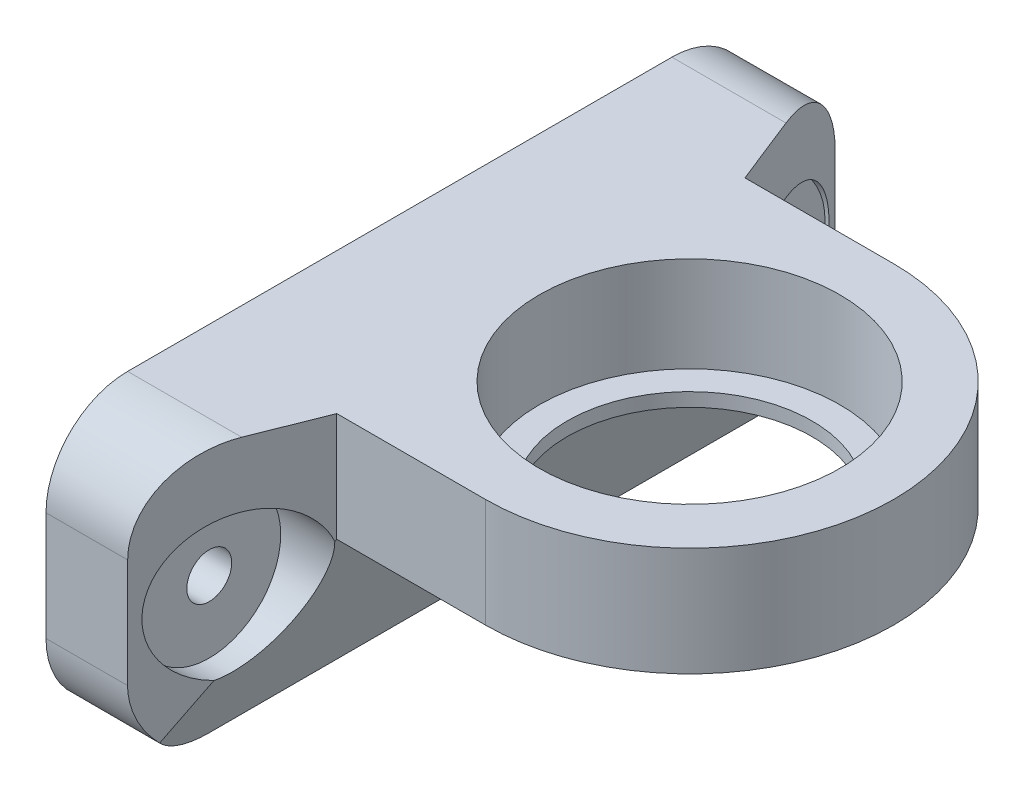
ISO-10303-21;
HEADER;
FILE_DESCRIPTION(('STEP AP214'),'2;1');
FILE_NAME('part.step','',(''),(''),'','','');
FILE_SCHEMA(('AUTOMOTIVE_DESIGN { 1 0 10303 214 1 1 1 1 }'));
ENDSEC;
DATA;
#1=APPLICATION_CONTEXT('core data for automotive mechanical design processes');
#2=APPLICATION_PROTOCOL_DEFINITION('international standard','automotive_design',2000,#1);
#3=PRODUCT_CONTEXT('',#1,'mechanical');
#4=PRODUCT('Part','Part','',(#3));
#5=PRODUCT_RELATED_PRODUCT_CATEGORY('part','',(#4));
#6=PRODUCT_DEFINITION_FORMATION('','',#4);
#7=PRODUCT_DEFINITION_CONTEXT('part definition',#1,'design');
#8=PRODUCT_DEFINITION('design','',#6,#7);
#9=PRODUCT_DEFINITION_SHAPE('','',#8);
#10=(LENGTH_UNIT() NAMED_UNIT(*) SI_UNIT(.MILLI.,.METRE.));
#11=(NAMED_UNIT(*) PLANE_ANGLE_UNIT() SI_UNIT($,.RADIAN.));
#12=(NAMED_UNIT(*) SI_UNIT($,.STERADIAN.) SOLID_ANGLE_UNIT());
#13=UNCERTAINTY_MEASURE_WITH_UNIT(LENGTH_MEASURE(1.E-05),#10,'distance_accuracy_value','');
#14=(GEOMETRIC_REPRESENTATION_CONTEXT(3) GLOBAL_UNCERTAINTY_ASSIGNED_CONTEXT((#13)) GLOBAL_UNIT_ASSIGNED_CONTEXT((#10,
#11,#12)) REPRESENTATION_CONTEXT('',''));
#15=CARTESIAN_POINT('',(0.,0.,0.));
#16=DIRECTION('',(0.,0.,1.));
#17=DIRECTION('',(1.,0.,0.));
#18=AXIS2_PLACEMENT_3D('',#15,#16,#17);
#19=CARTESIAN_POINT('',(36.3,10.,9.99999999999999));
#20=DIRECTION('',(-1.,0.,0.));
#21=DIRECTION('',(0.,-1.,0.));
#22=AXIS2_PLACEMENT_3D('',#19,#20,#21);
#23=CYLINDRICAL_SURFACE('',#22,1.65);
#24=CARTESIAN_POINT('',(1.,9.99999999999999,9.99999999999999));
#25=DIRECTION('',(1.,0.,0.));
#26=DIRECTION('',(0.,0.,-1.));
#27=AXIS2_PLACEMENT_3D('',#24,#25,#26);
#28=CIRCLE('',#27,1.65);
#29=CARTESIAN_POINT('',(1.,9.99999999999999,8.34999999999999));
#30=VERTEX_POINT('',#29);
#31=EDGE_CURVE('E204',#30,#30,#28,.F.);
#32=ORIENTED_EDGE('',*,*,#31,.T.);
#33=EDGE_LOOP('',(#32));
#34=FACE_BOUND('',#33,.T.);
#35=CARTESIAN_POINT('',(6.,9.99999999999999,9.99999999999999));
#36=DIRECTION('',(1.,0.,0.));
#37=DIRECTION('',(0.,0.,-1.));
#38=AXIS2_PLACEMENT_3D('',#35,#36,#37);
#39=CIRCLE('',#38,1.65);
#40=CARTESIAN_POINT('',(6.,9.99999999999999,8.34999999999999));
#41=VERTEX_POINT('',#40);
#42=EDGE_CURVE('E160',#41,#41,#39,.F.);
#43=ORIENTED_EDGE('',*,*,#42,.F.);
#44=EDGE_LOOP('',(#43));
#45=FACE_BOUND('',#44,.T.);
#46=ADVANCED_FACE('F34',(#34,#45),#23,.F.);
#47=CARTESIAN_POINT('',(36.3,10.,50.));
#48=DIRECTION('',(-1.,0.,0.));
#49=DIRECTION('',(0.,-1.,0.));
#50=AXIS2_PLACEMENT_3D('',#47,#48,#49);
#51=CYLINDRICAL_SURFACE('',#50,1.65);
#52=CARTESIAN_POINT('',(1.,10.,50.));
#53=DIRECTION('',(1.,0.,0.));
#54=DIRECTION('',(0.,0.,-1.));
#55=AXIS2_PLACEMENT_3D('',#52,#53,#54);
#56=CIRCLE('',#55,1.65);
#57=CARTESIAN_POINT('',(1.,10.,48.35));
#58=VERTEX_POINT('',#57);
#59=EDGE_CURVE('E200',#58,#58,#56,.F.);
#60=ORIENTED_EDGE('',*,*,#59,.T.);
#61=EDGE_LOOP('',(#60));
#62=FACE_BOUND('',#61,.T.);
#63=CARTESIAN_POINT('',(6.,10.,50.));
#64=DIRECTION('',(1.,0.,0.));
#65=DIRECTION('',(0.,0.,-1.));
#66=AXIS2_PLACEMENT_3D('',#63,#64,#65);
#67=CIRCLE('',#66,1.65);
#68=CARTESIAN_POINT('',(6.,10.,48.35));
#69=VERTEX_POINT('',#68);
#70=EDGE_CURVE('E192',#69,#69,#67,.F.);
#71=ORIENTED_EDGE('',*,*,#70,.F.);
#72=EDGE_LOOP('',(#71));
#73=FACE_BOUND('',#72,.T.);
#74=ADVANCED_FACE('F331',(#62,#73),#51,.F.);
#75=CARTESIAN_POINT('',(21.3,20.,30.));
#76=DIRECTION('',(0.,-1.,0.));
#77=DIRECTION('',(0.,0.,-1.));
#78=AXIS2_PLACEMENT_3D('',#75,#76,#77);
#79=CYLINDRICAL_SURFACE('',#78,9.00000000000001);
#80=CARTESIAN_POINT('',(21.3,12.,30.));
#81=DIRECTION('',(0.,1.,0.));
#82=DIRECTION('',(-1.,0.,0.));
#83=AXIS2_PLACEMENT_3D('',#80,#81,#82);
#84=CIRCLE('',#83,9.00000000000001);
#85=CARTESIAN_POINT('',(12.3,12.,30.));
#86=VERTEX_POINT('',#85);
#87=EDGE_CURVE('E169',#86,#86,#84,.T.);
#88=ORIENTED_EDGE('',*,*,#87,.F.);
#89=EDGE_LOOP('',(#88));
#90=FACE_BOUND('',#89,.T.);
#91=CARTESIAN_POINT('',(21.3,13.,30.));
#92=DIRECTION('',(0.,1.,0.));
#93=DIRECTION('',(-1.,0.,0.));
#94=AXIS2_PLACEMENT_3D('',#91,#92,#93);
#95=CIRCLE('',#94,9.00000000000001);
#96=CARTESIAN_POINT('',(12.3,13.,30.));
#97=VERTEX_POINT('',#96);
#98=EDGE_CURVE('E187',#97,#97,#95,.F.);
#99=ORIENTED_EDGE('',*,*,#98,.F.);
#100=EDGE_LOOP('',(#99));
#101=FACE_BOUND('',#100,.T.);
#102=ADVANCED_FACE('F368',(#90,#101),#79,.F.);
#103=CARTESIAN_POINT('',(0.,20.,60.));
#104=DIRECTION('',(1.,0.,0.));
#105=DIRECTION('',(0.,1.,0.));
#106=AXIS2_PLACEMENT_3D('',#103,#104,#105);
#107=PLANE('',#106);
#108=CARTESIAN_POINT('',(0.,9.99999999999999,9.99999999999999));
#109=DIRECTION('',(1.,0.,0.));
#110=DIRECTION('',(0.,0.,-1.));
#111=AXIS2_PLACEMENT_3D('',#108,#109,#110);
#112=CIRCLE('',#111,5.25);
#113=CARTESIAN_POINT('',(0.,9.99999999999999,4.74999999999999));
#114=VERTEX_POINT('',#113);
#115=EDGE_CURVE('E313',#114,#114,#112,.T.);
#116=ORIENTED_EDGE('',*,*,#115,.T.);
#117=EDGE_LOOP('',(#116));
#118=FACE_BOUND('',#117,.T.);
#119=CARTESIAN_POINT('',(0.,10.,50.));
#120=DIRECTION('',(1.,0.,0.));
#121=DIRECTION('',(0.,0.,-1.));
#122=AXIS2_PLACEMENT_3D('',#119,#120,#121);
#123=CIRCLE('',#122,5.25);
#124=CARTESIAN_POINT('',(0.,10.,44.75));
#125=VERTEX_POINT('',#124);
#126=EDGE_CURVE('E207',#125,#125,#123,.T.);
#127=ORIENTED_EDGE('',*,*,#126,.T.);
#128=EDGE_LOOP('',(#127));
#129=FACE_BOUND('',#128,.T.);
#130=DIRECTION('',(0.,-1.,0.));
#131=VECTOR('',#130,1.);
#132=CARTESIAN_POINT('',(0.,20.,4.));
#133=LINE('',#132,#131);
#134=CARTESIAN_POINT('',(0.,14.,4.));
#135=VERTEX_POINT('',#134);
#136=CARTESIAN_POINT('',(0.,6.,4.));
#137=VERTEX_POINT('',#136);
#138=EDGE_CURVE('E287',#135,#137,#133,.T.);
#139=ORIENTED_EDGE('',*,*,#138,.T.);
#140=CARTESIAN_POINT('',(0.,6.,10.));
#141=DIRECTION('',(1.,0.,0.));
#142=DIRECTION('',(0.,1.,0.));
#143=AXIS2_PLACEMENT_3D('',#140,#141,#142);
#144=CIRCLE('',#143,6.);
#145=CARTESIAN_POINT('',(0.,0.,10.));
#146=VERTEX_POINT('',#145);
#147=EDGE_CURVE('E219',#137,#146,#144,.F.);
#148=ORIENTED_EDGE('',*,*,#147,.T.);
#149=DIRECTION('',(0.,0.,-1.));
#150=VECTOR('',#149,1.);
#151=CARTESIAN_POINT('',(0.,0.,60.));
#152=LINE('',#151,#150);
#153=CARTESIAN_POINT('',(0.,0.,50.));
#154=VERTEX_POINT('',#153);
#155=EDGE_CURVE('E184',#154,#146,#152,.T.);
#156=ORIENTED_EDGE('',*,*,#155,.F.);
#157=CARTESIAN_POINT('',(0.,6.,50.));
#158=DIRECTION('',(1.,0.,0.));
#159=DIRECTION('',(0.,1.,0.));
#160=AXIS2_PLACEMENT_3D('',#157,#158,#159);
#161=CIRCLE('',#160,6.);
#162=CARTESIAN_POINT('',(0.,6.,56.));
#163=VERTEX_POINT('',#162);
#164=EDGE_CURVE('E213',#154,#163,#161,.F.);
#165=ORIENTED_EDGE('',*,*,#164,.T.);
#166=DIRECTION('',(0.,-1.,0.));
#167=VECTOR('',#166,1.);
#168=CARTESIAN_POINT('',(0.,20.,56.));
#169=LINE('',#168,#167);
#170=CARTESIAN_POINT('',(0.,14.,56.));
#171=VERTEX_POINT('',#170);
#172=EDGE_CURVE('E246',#171,#163,#169,.T.);
#173=ORIENTED_EDGE('',*,*,#172,.F.);
#174=CARTESIAN_POINT('',(0.,14.,50.));
#175=DIRECTION('',(1.,0.,0.));
#176=DIRECTION('',(0.,1.,0.));
#177=AXIS2_PLACEMENT_3D('',#174,#175,#176);
#178=CIRCLE('',#177,6.);
#179=CARTESIAN_POINT('',(0.,20.,50.));
#180=VERTEX_POINT('',#179);
#181=EDGE_CURVE('E215',#171,#180,#178,.F.);
#182=ORIENTED_EDGE('',*,*,#181,.T.);
#183=DIRECTION('',(0.,0.,-1.));
#184=VECTOR('',#183,1.);
#185=CARTESIAN_POINT('',(0.,20.,60.));
#186=LINE('',#185,#184);
#187=CARTESIAN_POINT('',(0.,20.,10.));
#188=VERTEX_POINT('',#187);
#189=EDGE_CURVE('E177',#180,#188,#186,.T.);
#190=ORIENTED_EDGE('',*,*,#189,.T.);
#191=CARTESIAN_POINT('',(0.,14.,9.99999999999999));
#192=DIRECTION('',(1.,0.,0.));
#193=DIRECTION('',(0.,1.,0.));
#194=AXIS2_PLACEMENT_3D('',#191,#192,#193);
#195=CIRCLE('',#194,6.);
#196=EDGE_CURVE('E217',#188,#135,#195,.F.);
#197=ORIENTED_EDGE('',*,*,#196,.T.);
#198=EDGE_LOOP('',(#139,#148,#156,#165,#173,#182,#190,#197));
#199=FACE_BOUND('',#198,.T.);
#200=ADVANCED_FACE('F391',(#118,#129,#199),#107,.F.);
#201=CARTESIAN_POINT('',(0.,0.,60.));
#202=DIRECTION('',(0.,1.,0.));
#203=DIRECTION('',(0.,0.,1.));
#204=AXIS2_PLACEMENT_3D('',#201,#202,#203);
#205=PLANE('',#204);
#206=ORIENTED_EDGE('',*,*,#155,.T.);
#207=DIRECTION('',(-1.,0.,0.));
#208=VECTOR('',#207,1.);
#209=CARTESIAN_POINT('',(0.,0.,9.99999999999999));
#210=LINE('',#209,#208);
#211=CARTESIAN_POINT('',(6.,0.,10.));
#212=VERTEX_POINT('',#211);
#213=EDGE_CURVE('E223',#146,#212,#210,.F.);
#214=ORIENTED_EDGE('',*,*,#213,.T.);
#215=DIRECTION('',(0.,0.,-1.));
#216=VECTOR('',#215,1.);
#217=CARTESIAN_POINT('',(6.,0.,60.));
#218=LINE('',#217,#216);
#219=CARTESIAN_POINT('',(6.,0.,50.));
#220=VERTEX_POINT('',#219);
#221=EDGE_CURVE('E182',#220,#212,#218,.T.);
#222=ORIENTED_EDGE('',*,*,#221,.F.);
#223=DIRECTION('',(1.,0.,0.));
#224=VECTOR('',#223,1.);
#225=CARTESIAN_POINT('',(0.,0.,50.));
#226=LINE('',#225,#224);
#227=EDGE_CURVE('E221',#220,#154,#226,.F.);
#228=ORIENTED_EDGE('',*,*,#227,.T.);
#229=EDGE_LOOP('',(#206,#214,#222,#228));
#230=FACE_BOUND('',#229,.T.);
#231=ADVANCED_FACE('F401',(#230),#205,.F.);
#232=CARTESIAN_POINT('',(6.,0.,60.));
#233=DIRECTION('',(-0.939692620785911,0.342020143325663,0.));
#234=DIRECTION('',(-0.342020143325663,-0.939692620785911,0.));
#235=AXIS2_PLACEMENT_3D('',#232,#233,#234);
#236=PLANE('',#235);
#237=ORIENTED_EDGE('',*,*,#221,.T.);
#238=CARTESIAN_POINT('',(8.18382140559717,6.,10.));
#239=DIRECTION('',(-0.939692620785911,0.342020143325663,0.));
#240=DIRECTION('',(-0.342020143325663,-0.939692620785911,0.));
#241=AXIS2_PLACEMENT_3D('',#238,#239,#240);
#242=ELLIPSE('',#241,6.38506663485546,6.);
#243=CARTESIAN_POINT('',(6.66769785929932,1.83448479144311,5.68161105882283));
#244=VERTEX_POINT('',#243);
#245=EDGE_CURVE('E227',#212,#244,#242,.F.);
#246=ORIENTED_EDGE('',*,*,#245,.T.);
#247=DIRECTION('',(0.259137109387964,0.711973356586187,0.652642243537337));
#248=VECTOR('',#247,1.);
#249=CARTESIAN_POINT('',(15.4709341694655,26.0211777717482,27.8527462907692));
#250=LINE('',#249,#248);
#251=CARTESIAN_POINT('',(7.80390166501923,4.95617909155704,8.5431641672606));
#252=VERTEX_POINT('',#251);
#253=EDGE_CURVE('E158',#244,#252,#250,.T.);
#254=ORIENTED_EDGE('',*,*,#253,.T.);
#255=CARTESIAN_POINT('',(9.63970234266195,9.99999999999999,9.99999999999999));
#256=DIRECTION('',(-0.939692620785911,0.342020143325663,0.));
#257=DIRECTION('',(-0.342020143325663,-0.939692620785911,0.));
#258=AXIS2_PLACEMENT_3D('',#255,#256,#257);
#259=ELLIPSE('',#258,5.58693330549853,5.25);
#260=CARTESIAN_POINT('',(10.3272799416385,11.8891039273109,14.8983452667017));
#261=VERTEX_POINT('',#260);
#262=EDGE_CURVE('E145',#261,#252,#259,.F.);
#263=ORIENTED_EDGE('',*,*,#262,.F.);
#264=CARTESIAN_POINT('',(10.3676428111943,12.,15.));
#265=VERTEX_POINT('',#264);
#266=EDGE_CURVE('E156',#261,#265,#250,.T.);
#267=ORIENTED_EDGE('',*,*,#266,.T.);
#268=DIRECTION('',(0.,0.,-1.));
#269=VECTOR('',#268,1.);
#270=CARTESIAN_POINT('',(10.3676428111943,12.,60.));
#271=LINE('',#270,#269);
#272=CARTESIAN_POINT('',(10.3676428111943,12.,45.));
#273=VERTEX_POINT('',#272);
#274=EDGE_CURVE('E180',#273,#265,#271,.T.);
#275=ORIENTED_EDGE('',*,*,#274,.F.);
#276=DIRECTION('',(-0.259137109387964,-0.711973356586187,0.652642243537337));
#277=VECTOR('',#276,1.);
#278=CARTESIAN_POINT('',(5.32350470218103,-1.85865555512487,57.7037675921978));
#279=LINE('',#278,#277);
#280=CARTESIAN_POINT('',(10.3272799416385,11.8891039273109,45.1016547332983));
#281=VERTEX_POINT('',#280);
#282=EDGE_CURVE('E260',#273,#281,#279,.T.);
#283=ORIENTED_EDGE('',*,*,#282,.T.);
#284=CARTESIAN_POINT('',(9.63970234266195,10.,50.));
#285=DIRECTION('',(-0.939692620785911,0.342020143325663,0.));
#286=DIRECTION('',(-0.342020143325663,-0.939692620785911,0.));
#287=AXIS2_PLACEMENT_3D('',#284,#285,#286);
#288=ELLIPSE('',#287,5.58693330549852,5.25);
#289=CARTESIAN_POINT('',(7.80390166501923,4.95617909155703,51.4568358327394));
#290=VERTEX_POINT('',#289);
#291=EDGE_CURVE('E195',#290,#281,#288,.F.);
#292=ORIENTED_EDGE('',*,*,#291,.F.);
#293=CARTESIAN_POINT('',(6.66769785929932,1.8344847914431,54.3183889411772));
#294=VERTEX_POINT('',#293);
#295=EDGE_CURVE('E264',#290,#294,#279,.T.);
#296=ORIENTED_EDGE('',*,*,#295,.T.);
#297=CARTESIAN_POINT('',(8.18382140559717,6.,50.));
#298=DIRECTION('',(-0.939692620785911,0.342020143325663,0.));
#299=DIRECTION('',(0.342020143325663,0.939692620785911,0.));
#300=AXIS2_PLACEMENT_3D('',#297,#298,#299);
#301=ELLIPSE('',#300,6.38506663485546,6.);
#302=EDGE_CURVE('E225',#294,#220,#301,.F.);
#303=ORIENTED_EDGE('',*,*,#302,.T.);
#304=EDGE_LOOP('',(#237,#246,#254,#263,#267,#275,#283,#292,#296,#303));
#305=FACE_BOUND('',#304,.T.);
#306=ADVANCED_FACE('F154',(#305),#236,.F.);
#307=CARTESIAN_POINT('',(10.3676428111943,12.,60.));
#308=DIRECTION('',(0.,1.,0.));
#309=DIRECTION('',(-1.,0.,0.));
#310=AXIS2_PLACEMENT_3D('',#307,#308,#309);
#311=PLANE('',#310);
#312=ORIENTED_EDGE('',*,*,#87,.T.);
#313=EDGE_LOOP('',(#312));
#314=FACE_BOUND('',#313,.T.);
#315=ORIENTED_EDGE('',*,*,#274,.T.);
#316=DIRECTION('',(1.,0.,0.));
#317=VECTOR('',#316,1.);
#318=CARTESIAN_POINT('',(10.3676428111944,12.,15.));
#319=LINE('',#318,#317);
#320=CARTESIAN_POINT('',(21.3,12.,15.));
#321=VERTEX_POINT('',#320);
#322=EDGE_CURVE('E167',#265,#321,#319,.T.);
#323=ORIENTED_EDGE('',*,*,#322,.T.);
#324=CARTESIAN_POINT('',(21.3,12.,30.));
#325=DIRECTION('',(0.,1.,0.));
#326=DIRECTION('',(-1.,0.,0.));
#327=AXIS2_PLACEMENT_3D('',#324,#325,#326);
#328=CIRCLE('',#327,15.);
#329=CARTESIAN_POINT('',(21.3,12.,45.));
#330=VERTEX_POINT('',#329);
#331=EDGE_CURVE('E171',#321,#330,#328,.F.);
#332=ORIENTED_EDGE('',*,*,#331,.T.);
#333=DIRECTION('',(-1.,0.,0.));
#334=VECTOR('',#333,1.);
#335=CARTESIAN_POINT('',(10.3676428111943,12.,45.));
#336=LINE('',#335,#334);
#337=EDGE_CURVE('E263',#330,#273,#336,.T.);
#338=ORIENTED_EDGE('',*,*,#337,.T.);
#339=EDGE_LOOP('',(#315,#323,#332,#338));
#340=FACE_BOUND('',#339,.T.);
#341=ADVANCED_FACE('F268',(#314,#340),#311,.F.);
#342=CARTESIAN_POINT('',(49.,20.,60.));
#343=DIRECTION('',(0.,-1.,0.));
#344=DIRECTION('',(1.,0.,0.));
#345=AXIS2_PLACEMENT_3D('',#342,#343,#344);
#346=PLANE('',#345);
#347=CARTESIAN_POINT('',(21.3,20.,30.));
#348=DIRECTION('',(0.,1.,0.));
#349=DIRECTION('',(-1.,0.,0.));
#350=AXIS2_PLACEMENT_3D('',#347,#348,#349);
#351=CIRCLE('',#350,11.05);
#352=CARTESIAN_POINT('',(10.25,20.,30.));
#353=VERTEX_POINT('',#352);
#354=EDGE_CURVE('E299',#353,#353,#351,.T.);
#355=ORIENTED_EDGE('',*,*,#354,.F.);
#356=EDGE_LOOP('',(#355));
#357=FACE_BOUND('',#356,.T.);
#358=DIRECTION('',(-0.369032637895796,0.,-0.929416436355453));
#359=VECTOR('',#358,1.);
#360=CARTESIAN_POINT('',(10.3676428111943,20.,15.));
#361=LINE('',#360,#359);
#362=CARTESIAN_POINT('',(10.3676428111943,20.,15.));
#363=VERTEX_POINT('',#362);
#364=CARTESIAN_POINT('',(8.38235062428783,20.,9.99999999999999));
#365=VERTEX_POINT('',#364);
#366=EDGE_CURVE('E256',#363,#365,#361,.T.);
#367=ORIENTED_EDGE('',*,*,#366,.T.);
#368=DIRECTION('',(-1.,0.,0.));
#369=VECTOR('',#368,1.);
#370=CARTESIAN_POINT('',(49.,20.,9.99999999999999));
#371=LINE('',#370,#369);
#372=EDGE_CURVE('E236',#365,#188,#371,.T.);
#373=ORIENTED_EDGE('',*,*,#372,.T.);
#374=ORIENTED_EDGE('',*,*,#189,.F.);
#375=DIRECTION('',(1.,0.,0.));
#376=VECTOR('',#375,1.);
#377=CARTESIAN_POINT('',(49.,20.,50.));
#378=LINE('',#377,#376);
#379=CARTESIAN_POINT('',(8.38235062428782,20.,50.));
#380=VERTEX_POINT('',#379);
#381=EDGE_CURVE('E233',#180,#380,#378,.T.);
#382=ORIENTED_EDGE('',*,*,#381,.T.);
#383=DIRECTION('',(0.369032637895797,0.,-0.929416436355453));
#384=VECTOR('',#383,1.);
#385=CARTESIAN_POINT('',(10.3676428111943,20.,45.));
#386=LINE('',#385,#384);
#387=CARTESIAN_POINT('',(10.3676428111943,20.,45.));
#388=VERTEX_POINT('',#387);
#389=EDGE_CURVE('E190',#380,#388,#386,.T.);
#390=ORIENTED_EDGE('',*,*,#389,.T.);
#391=DIRECTION('',(1.,0.,0.));
#392=VECTOR('',#391,1.);
#393=CARTESIAN_POINT('',(10.3676428111943,20.,45.));
#394=LINE('',#393,#392);
#395=CARTESIAN_POINT('',(21.3,20.,45.));
#396=VERTEX_POINT('',#395);
#397=EDGE_CURVE('E295',#388,#396,#394,.T.);
#398=ORIENTED_EDGE('',*,*,#397,.T.);
#399=CARTESIAN_POINT('',(21.3,20.,30.));
#400=DIRECTION('',(0.,1.,0.));
#401=DIRECTION('',(0.,0.,-1.));
#402=AXIS2_PLACEMENT_3D('',#399,#400,#401);
#403=CIRCLE('',#402,15.);
#404=CARTESIAN_POINT('',(21.3,20.,15.));
#405=VERTEX_POINT('',#404);
#406=EDGE_CURVE('E293',#396,#405,#403,.T.);
#407=ORIENTED_EDGE('',*,*,#406,.T.);
#408=DIRECTION('',(-1.,0.,0.));
#409=VECTOR('',#408,1.);
#410=CARTESIAN_POINT('',(21.3,20.,15.));
#411=LINE('',#410,#409);
#412=EDGE_CURVE('E279',#405,#363,#411,.T.);
#413=ORIENTED_EDGE('',*,*,#412,.T.);
#414=EDGE_LOOP('',(#367,#373,#374,#382,#390,#398,#407,#413));
#415=FACE_BOUND('',#414,.T.);
#416=ADVANCED_FACE('F376',(#357,#415),#346,.F.);
#417=CARTESIAN_POINT('',(10.3676428111943,20.,15.));
#418=DIRECTION('',(-0.929416436355453,0.,0.369032637895796));
#419=DIRECTION('',(0.369032637895796,0.,0.929416436355453));
#420=AXIS2_PLACEMENT_3D('',#417,#418,#419);
#421=PLANE('',#420);
#422=ORIENTED_EDGE('',*,*,#253,.F.);
#423=CARTESIAN_POINT('',(8.38235062428783,6.,10.));
#424=DIRECTION('',(-0.929416436355453,0.,0.369032637895796));
#425=DIRECTION('',(-0.369032637895796,0.,-0.929416436355453));
#426=AXIS2_PLACEMENT_3D('',#423,#424,#425);
#427=ELLIPSE('',#426,6.45566375340635,6.);
#428=CARTESIAN_POINT('',(6.00000000000001,6.,4.));
#429=VERTEX_POINT('',#428);
#430=EDGE_CURVE('E231',#244,#429,#427,.F.);
#431=ORIENTED_EDGE('',*,*,#430,.T.);
#432=DIRECTION('',(0.,-1.,0.));
#433=VECTOR('',#432,1.);
#434=CARTESIAN_POINT('',(6.00000000000001,20.,4.));
#435=LINE('',#434,#433);
#436=CARTESIAN_POINT('',(6.00000000000001,14.,4.));
#437=VERTEX_POINT('',#436);
#438=EDGE_CURVE('E282',#437,#429,#435,.T.);
#439=ORIENTED_EDGE('',*,*,#438,.F.);
#440=CARTESIAN_POINT('',(8.38235062428783,14.,9.99999999999999));
#441=DIRECTION('',(-0.929416436355453,0.,0.369032637895796));
#442=DIRECTION('',(-0.369032637895796,0.,-0.929416436355453));
#443=AXIS2_PLACEMENT_3D('',#440,#441,#442);
#444=ELLIPSE('',#443,6.45566375340635,6.);
#445=EDGE_CURVE('E229',#437,#365,#444,.F.);
#446=ORIENTED_EDGE('',*,*,#445,.T.);
#447=ORIENTED_EDGE('',*,*,#366,.F.);
#448=DIRECTION('',(0.,-1.,0.));
#449=VECTOR('',#448,1.);
#450=CARTESIAN_POINT('',(10.3676428111943,20.,15.));
#451=LINE('',#450,#449);
#452=EDGE_CURVE('E165',#363,#265,#451,.T.);
#453=ORIENTED_EDGE('',*,*,#452,.T.);
#454=ORIENTED_EDGE('',*,*,#266,.F.);
#455=CARTESIAN_POINT('',(8.38235062428783,9.99999999999999,9.99999999999999));
#456=DIRECTION('',(-0.929416436355453,0.,0.369032637895796));
#457=DIRECTION('',(-0.369032637895796,0.,-0.929416436355453));
#458=AXIS2_PLACEMENT_3D('',#455,#456,#457);
#459=ELLIPSE('',#458,5.64870578423056,5.25);
#460=EDGE_CURVE('E142',#252,#261,#459,.F.);
#461=ORIENTED_EDGE('',*,*,#460,.F.);
#462=EDGE_LOOP('',(#422,#431,#439,#446,#447,#453,#454,#461));
#463=FACE_BOUND('',#462,.T.);
#464=ADVANCED_FACE('F163',(#463),#421,.F.);
#465=CARTESIAN_POINT('',(21.3,20.,15.));
#466=DIRECTION('',(0.,0.,1.));
#467=DIRECTION('',(1.,0.,0.));
#468=AXIS2_PLACEMENT_3D('',#465,#466,#467);
#469=PLANE('',#468);
#470=ORIENTED_EDGE('',*,*,#452,.F.);
#471=ORIENTED_EDGE('',*,*,#412,.F.);
#472=DIRECTION('',(0.,-1.,0.));
#473=VECTOR('',#472,1.);
#474=CARTESIAN_POINT('',(21.3,20.,15.));
#475=LINE('',#474,#473);
#476=EDGE_CURVE('E274',#405,#321,#475,.T.);
#477=ORIENTED_EDGE('',*,*,#476,.T.);
#478=ORIENTED_EDGE('',*,*,#322,.F.);
#479=EDGE_LOOP('',(#470,#471,#477,#478));
#480=FACE_BOUND('',#479,.T.);
#481=ADVANCED_FACE('F277',(#480),#469,.F.);
#482=CARTESIAN_POINT('',(21.3,20.,30.));
#483=DIRECTION('',(0.,-1.,0.));
#484=DIRECTION('',(0.,0.,-1.));
#485=AXIS2_PLACEMENT_3D('',#482,#483,#484);
#486=CYLINDRICAL_SURFACE('',#485,15.);
#487=ORIENTED_EDGE('',*,*,#476,.F.);
#488=ORIENTED_EDGE('',*,*,#406,.F.);
#489=DIRECTION('',(0.,-1.,0.));
#490=VECTOR('',#489,1.);
#491=CARTESIAN_POINT('',(21.3,20.,45.));
#492=LINE('',#491,#490);
#493=EDGE_CURVE('E254',#396,#330,#492,.T.);
#494=ORIENTED_EDGE('',*,*,#493,.T.);
#495=ORIENTED_EDGE('',*,*,#331,.F.);
#496=EDGE_LOOP('',(#487,#488,#494,#495));
#497=FACE_BOUND('',#496,.T.);
#498=ADVANCED_FACE('F272',(#497),#486,.T.);
#499=CARTESIAN_POINT('',(10.3676428111943,20.,45.));
#500=DIRECTION('',(0.,0.,-1.));
#501=DIRECTION('',(-1.,0.,0.));
#502=AXIS2_PLACEMENT_3D('',#499,#500,#501);
#503=PLANE('',#502);
#504=ORIENTED_EDGE('',*,*,#493,.F.);
#505=ORIENTED_EDGE('',*,*,#397,.F.);
#506=DIRECTION('',(0.,-1.,0.));
#507=VECTOR('',#506,1.);
#508=CARTESIAN_POINT('',(10.3676428111943,20.,45.));
#509=LINE('',#508,#507);
#510=EDGE_CURVE('E251',#388,#273,#509,.T.);
#511=ORIENTED_EDGE('',*,*,#510,.T.);
#512=ORIENTED_EDGE('',*,*,#337,.F.);
#513=EDGE_LOOP('',(#504,#505,#511,#512));
#514=FACE_BOUND('',#513,.T.);
#515=ADVANCED_FACE('F381',(#514),#503,.F.);
#516=CARTESIAN_POINT('',(10.3676428111943,20.,45.));
#517=DIRECTION('',(-0.929416436355453,0.,-0.369032637895797));
#518=DIRECTION('',(-0.369032637895797,0.,0.929416436355453));
#519=AXIS2_PLACEMENT_3D('',#516,#517,#518);
#520=PLANE('',#519);
#521=ORIENTED_EDGE('',*,*,#389,.F.);
#522=CARTESIAN_POINT('',(8.38235062428782,14.,50.));
#523=DIRECTION('',(-0.929416436355453,0.,-0.369032637895797));
#524=DIRECTION('',(0.369032637895797,0.,-0.929416436355453));
#525=AXIS2_PLACEMENT_3D('',#522,#523,#524);
#526=ELLIPSE('',#525,6.45566375340635,6.);
#527=CARTESIAN_POINT('',(6.,14.,56.));
#528=VERTEX_POINT('',#527);
#529=EDGE_CURVE('E57',#380,#528,#526,.F.);
#530=ORIENTED_EDGE('',*,*,#529,.T.);
#531=DIRECTION('',(0.,-1.,0.));
#532=VECTOR('',#531,1.);
#533=CARTESIAN_POINT('',(6.,20.,56.));
#534=LINE('',#533,#532);
#535=CARTESIAN_POINT('',(6.,6.,56.));
#536=VERTEX_POINT('',#535);
#537=EDGE_CURVE('E243',#528,#536,#534,.T.);
#538=ORIENTED_EDGE('',*,*,#537,.T.);
#539=CARTESIAN_POINT('',(8.38235062428783,6.,50.));
#540=DIRECTION('',(-0.929416436355453,0.,-0.369032637895797));
#541=DIRECTION('',(0.369032637895797,0.,-0.929416436355453));
#542=AXIS2_PLACEMENT_3D('',#539,#540,#541);
#543=ELLIPSE('',#542,6.45566375340635,6.);
#544=EDGE_CURVE('E49',#536,#294,#543,.F.);
#545=ORIENTED_EDGE('',*,*,#544,.T.);
#546=ORIENTED_EDGE('',*,*,#295,.F.);
#547=CARTESIAN_POINT('',(8.38235062428783,10.,50.));
#548=DIRECTION('',(-0.929416436355453,0.,-0.369032637895797));
#549=DIRECTION('',(-0.369032637895797,0.,0.929416436355453));
#550=AXIS2_PLACEMENT_3D('',#547,#548,#549);
#551=ELLIPSE('',#550,5.64870578423055,5.25);
#552=EDGE_CURVE('E150',#281,#290,#551,.F.);
#553=ORIENTED_EDGE('',*,*,#552,.F.);
#554=ORIENTED_EDGE('',*,*,#282,.F.);
#555=ORIENTED_EDGE('',*,*,#510,.F.);
#556=EDGE_LOOP('',(#521,#530,#538,#545,#546,#553,#554,#555));
#557=FACE_BOUND('',#556,.T.);
#558=ADVANCED_FACE('F248',(#557),#520,.F.);
#559=CARTESIAN_POINT('',(6.00000000000001,20.,4.));
#560=DIRECTION('',(0.,0.,1.));
#561=DIRECTION('',(1.,0.,0.));
#562=AXIS2_PLACEMENT_3D('',#559,#560,#561);
#563=PLANE('',#562);
#564=ORIENTED_EDGE('',*,*,#438,.T.);
#565=DIRECTION('',(-1.,0.,0.));
#566=VECTOR('',#565,1.);
#567=CARTESIAN_POINT('',(6.00000000000001,6.,4.));
#568=LINE('',#567,#566);
#569=EDGE_CURVE('E210',#429,#137,#568,.T.);
#570=ORIENTED_EDGE('',*,*,#569,.T.);
#571=ORIENTED_EDGE('',*,*,#138,.F.);
#572=DIRECTION('',(-1.,0.,0.));
#573=VECTOR('',#572,1.);
#574=CARTESIAN_POINT('',(6.00000000000001,14.,4.));
#575=LINE('',#574,#573);
#576=EDGE_CURVE('E149',#135,#437,#575,.F.);
#577=ORIENTED_EDGE('',*,*,#576,.T.);
#578=EDGE_LOOP('',(#564,#570,#571,#577));
#579=FACE_BOUND('',#578,.T.);
#580=ADVANCED_FACE('F370',(#579),#563,.F.);
#581=CARTESIAN_POINT('',(6.,20.,56.));
#582=DIRECTION('',(0.,0.,-1.));
#583=DIRECTION('',(-1.,0.,0.));
#584=AXIS2_PLACEMENT_3D('',#581,#582,#583);
#585=PLANE('',#584);
#586=ORIENTED_EDGE('',*,*,#537,.F.);
#587=DIRECTION('',(1.,0.,0.));
#588=VECTOR('',#587,1.);
#589=CARTESIAN_POINT('',(6.,14.,56.));
#590=LINE('',#589,#588);
#591=EDGE_CURVE('E11',#528,#171,#590,.F.);
#592=ORIENTED_EDGE('',*,*,#591,.T.);
#593=ORIENTED_EDGE('',*,*,#172,.T.);
#594=DIRECTION('',(1.,0.,0.));
#595=VECTOR('',#594,1.);
#596=CARTESIAN_POINT('',(6.,6.,56.));
#597=LINE('',#596,#595);
#598=EDGE_CURVE('E42',#163,#536,#597,.T.);
#599=ORIENTED_EDGE('',*,*,#598,.T.);
#600=EDGE_LOOP('',(#586,#592,#593,#599));
#601=FACE_BOUND('',#600,.T.);
#602=ADVANCED_FACE('F242',(#601),#585,.F.);
#603=CARTESIAN_POINT('',(21.3,13.,30.));
#604=DIRECTION('',(0.,1.,0.));
#605=DIRECTION('',(-1.,0.,0.));
#606=AXIS2_PLACEMENT_3D('',#603,#604,#605);
#607=PLANE('',#606);
#608=CARTESIAN_POINT('',(21.3,13.,30.));
#609=DIRECTION('',(0.,1.,0.));
#610=DIRECTION('',(-1.,0.,0.));
#611=AXIS2_PLACEMENT_3D('',#608,#609,#610);
#612=CIRCLE('',#611,11.05);
#613=CARTESIAN_POINT('',(10.25,13.,30.));
#614=VERTEX_POINT('',#613);
#615=EDGE_CURVE('E191',#614,#614,#612,.T.);
#616=ORIENTED_EDGE('',*,*,#615,.T.);
#617=EDGE_LOOP('',(#616));
#618=FACE_BOUND('',#617,.T.);
#619=ORIENTED_EDGE('',*,*,#98,.T.);
#620=EDGE_LOOP('',(#619));
#621=FACE_BOUND('',#620,.T.);
#622=ADVANCED_FACE('F359',(#618,#621),#607,.T.);
#623=CARTESIAN_POINT('',(21.3,13.,30.));
#624=DIRECTION('',(0.,1.,0.));
#625=DIRECTION('',(-1.,0.,0.));
#626=AXIS2_PLACEMENT_3D('',#623,#624,#625);
#627=CYLINDRICAL_SURFACE('',#626,11.05);
#628=ORIENTED_EDGE('',*,*,#615,.F.);
#629=EDGE_LOOP('',(#628));
#630=FACE_BOUND('',#629,.T.);
#631=ORIENTED_EDGE('',*,*,#354,.T.);
#632=EDGE_LOOP('',(#631));
#633=FACE_BOUND('',#632,.T.);
#634=ADVANCED_FACE('F357',(#630,#633),#627,.F.);
#635=CARTESIAN_POINT('',(16.,10.,50.));
#636=DIRECTION('',(-1.,0.,0.));
#637=DIRECTION('',(0.,0.,1.));
#638=AXIS2_PLACEMENT_3D('',#635,#636,#637);
#639=CYLINDRICAL_SURFACE('',#638,5.25);
#640=CARTESIAN_POINT('',(6.,10.,50.));
#641=DIRECTION('',(1.,0.,0.));
#642=DIRECTION('',(0.,0.,-1.));
#643=AXIS2_PLACEMENT_3D('',#640,#641,#642);
#644=CIRCLE('',#643,5.25);
#645=CARTESIAN_POINT('',(6.,10.,44.75));
#646=VERTEX_POINT('',#645);
#647=EDGE_CURVE('E159',#646,#646,#644,.T.);
#648=ORIENTED_EDGE('',*,*,#647,.F.);
#649=EDGE_LOOP('',(#648));
#650=FACE_BOUND('',#649,.T.);
#651=ORIENTED_EDGE('',*,*,#291,.T.);
#652=ORIENTED_EDGE('',*,*,#552,.T.);
#653=EDGE_LOOP('',(#651,#652));
#654=FACE_BOUND('',#653,.T.);
#655=ADVANCED_FACE('F353',(#650,#654),#639,.F.);
#656=CARTESIAN_POINT('',(6.,10.,50.));
#657=DIRECTION('',(1.,0.,0.));
#658=DIRECTION('',(0.,0.,-1.));
#659=AXIS2_PLACEMENT_3D('',#656,#657,#658);
#660=PLANE('',#659);
#661=ORIENTED_EDGE('',*,*,#647,.T.);
#662=EDGE_LOOP('',(#661));
#663=FACE_BOUND('',#662,.T.);
#664=ORIENTED_EDGE('',*,*,#70,.T.);
#665=EDGE_LOOP('',(#664));
#666=FACE_BOUND('',#665,.T.);
#667=ADVANCED_FACE('F346',(#663,#666),#660,.T.);
#668=CARTESIAN_POINT('',(16.,9.99999999999999,9.99999999999999));
#669=DIRECTION('',(-1.,0.,0.));
#670=DIRECTION('',(0.,0.,1.));
#671=AXIS2_PLACEMENT_3D('',#668,#669,#670);
#672=CYLINDRICAL_SURFACE('',#671,5.25);
#673=CARTESIAN_POINT('',(6.,9.99999999999999,9.99999999999999));
#674=DIRECTION('',(1.,0.,0.));
#675=DIRECTION('',(0.,0.,-1.));
#676=AXIS2_PLACEMENT_3D('',#673,#674,#675);
#677=CIRCLE('',#676,5.25);
#678=CARTESIAN_POINT('',(6.,9.99999999999999,4.74999999999999));
#679=VERTEX_POINT('',#678);
#680=EDGE_CURVE('E198',#679,#679,#677,.T.);
#681=ORIENTED_EDGE('',*,*,#680,.F.);
#682=EDGE_LOOP('',(#681));
#683=FACE_BOUND('',#682,.T.);
#684=ORIENTED_EDGE('',*,*,#262,.T.);
#685=ORIENTED_EDGE('',*,*,#460,.T.);
#686=EDGE_LOOP('',(#684,#685));
#687=FACE_BOUND('',#686,.T.);
#688=ADVANCED_FACE('F144',(#683,#687),#672,.F.);
#689=CARTESIAN_POINT('',(6.,9.99999999999999,9.99999999999999));
#690=DIRECTION('',(1.,0.,0.));
#691=DIRECTION('',(0.,0.,-1.));
#692=AXIS2_PLACEMENT_3D('',#689,#690,#691);
#693=PLANE('',#692);
#694=ORIENTED_EDGE('',*,*,#680,.T.);
#695=EDGE_LOOP('',(#694));
#696=FACE_BOUND('',#695,.T.);
#697=ORIENTED_EDGE('',*,*,#42,.T.);
#698=EDGE_LOOP('',(#697));
#699=FACE_BOUND('',#698,.T.);
#700=ADVANCED_FACE('F335',(#696,#699),#693,.T.);
#701=CARTESIAN_POINT('',(1.,10.,50.));
#702=DIRECTION('',(1.,0.,0.));
#703=DIRECTION('',(0.,0.,-1.));
#704=AXIS2_PLACEMENT_3D('',#701,#702,#703);
#705=PLANE('',#704);
#706=CARTESIAN_POINT('',(1.,10.,50.));
#707=DIRECTION('',(1.,0.,0.));
#708=DIRECTION('',(0.,0.,-1.));
#709=AXIS2_PLACEMENT_3D('',#706,#707,#708);
#710=CIRCLE('',#709,5.25);
#711=CARTESIAN_POINT('',(1.,10.,44.75));
#712=VERTEX_POINT('',#711);
#713=EDGE_CURVE('E203',#712,#712,#710,.T.);
#714=ORIENTED_EDGE('',*,*,#713,.F.);
#715=EDGE_LOOP('',(#714));
#716=FACE_BOUND('',#715,.T.);
#717=ORIENTED_EDGE('',*,*,#59,.F.);
#718=EDGE_LOOP('',(#717));
#719=FACE_BOUND('',#718,.T.);
#720=ADVANCED_FACE('F337',(#716,#719),#705,.F.);
#721=CARTESIAN_POINT('',(1.,10.,50.));
#722=DIRECTION('',(-1.,0.,0.));
#723=DIRECTION('',(0.,0.,1.));
#724=AXIS2_PLACEMENT_3D('',#721,#722,#723);
#725=CYLINDRICAL_SURFACE('',#724,5.25);
#726=ORIENTED_EDGE('',*,*,#713,.T.);
#727=EDGE_LOOP('',(#726));
#728=FACE_BOUND('',#727,.T.);
#729=ORIENTED_EDGE('',*,*,#126,.F.);
#730=EDGE_LOOP('',(#729));
#731=FACE_BOUND('',#730,.T.);
#732=ADVANCED_FACE('F325',(#728,#731),#725,.F.);
#733=CARTESIAN_POINT('',(1.,9.99999999999999,9.99999999999999));
#734=DIRECTION('',(1.,0.,0.));
#735=DIRECTION('',(0.,0.,-1.));
#736=AXIS2_PLACEMENT_3D('',#733,#734,#735);
#737=PLANE('',#736);
#738=CARTESIAN_POINT('',(1.,9.99999999999999,9.99999999999999));
#739=DIRECTION('',(1.,0.,0.));
#740=DIRECTION('',(0.,0.,-1.));
#741=AXIS2_PLACEMENT_3D('',#738,#739,#740);
#742=CIRCLE('',#741,5.25);
#743=CARTESIAN_POINT('',(1.,9.99999999999999,4.74999999999999));
#744=VERTEX_POINT('',#743);
#745=EDGE_CURVE('E208',#744,#744,#742,.T.);
#746=ORIENTED_EDGE('',*,*,#745,.F.);
#747=EDGE_LOOP('',(#746));
#748=FACE_BOUND('',#747,.T.);
#749=ORIENTED_EDGE('',*,*,#31,.F.);
#750=EDGE_LOOP('',(#749));
#751=FACE_BOUND('',#750,.T.);
#752=ADVANCED_FACE('F322',(#748,#751),#737,.F.);
#753=CARTESIAN_POINT('',(1.,9.99999999999999,9.99999999999999));
#754=DIRECTION('',(-1.,0.,0.));
#755=DIRECTION('',(0.,0.,1.));
#756=AXIS2_PLACEMENT_3D('',#753,#754,#755);
#757=CYLINDRICAL_SURFACE('',#756,5.25);
#758=ORIENTED_EDGE('',*,*,#745,.T.);
#759=EDGE_LOOP('',(#758));
#760=FACE_BOUND('',#759,.T.);
#761=ORIENTED_EDGE('',*,*,#115,.F.);
#762=EDGE_LOOP('',(#761));
#763=FACE_BOUND('',#762,.T.);
#764=ADVANCED_FACE('F319',(#760,#763),#757,.F.);
#765=CARTESIAN_POINT('',(6.00000000000001,6.,10.));
#766=DIRECTION('',(-1.,0.,0.));
#767=DIRECTION('',(0.,0.,1.));
#768=AXIS2_PLACEMENT_3D('',#765,#766,#767);
#769=CYLINDRICAL_SURFACE('',#768,6.);
#770=ORIENTED_EDGE('',*,*,#245,.F.);
#771=ORIENTED_EDGE('',*,*,#213,.F.);
#772=ORIENTED_EDGE('',*,*,#147,.F.);
#773=ORIENTED_EDGE('',*,*,#569,.F.);
#774=ORIENTED_EDGE('',*,*,#430,.F.);
#775=EDGE_LOOP('',(#770,#771,#772,#773,#774));
#776=FACE_BOUND('',#775,.T.);
#777=ADVANCED_FACE('F408',(#776),#769,.T.);
#778=CARTESIAN_POINT('',(49.,14.,9.99999999999999));
#779=DIRECTION('',(-1.,0.,0.));
#780=DIRECTION('',(0.,-1.,0.));
#781=AXIS2_PLACEMENT_3D('',#778,#779,#780);
#782=CYLINDRICAL_SURFACE('',#781,6.);
#783=ORIENTED_EDGE('',*,*,#445,.F.);
#784=ORIENTED_EDGE('',*,*,#576,.F.);
#785=ORIENTED_EDGE('',*,*,#196,.F.);
#786=ORIENTED_EDGE('',*,*,#372,.F.);
#787=EDGE_LOOP('',(#783,#784,#785,#786));
#788=FACE_BOUND('',#787,.T.);
#789=ADVANCED_FACE('F411',(#788),#782,.T.);
#790=CARTESIAN_POINT('',(49.,14.,50.));
#791=DIRECTION('',(1.,0.,0.));
#792=DIRECTION('',(0.,1.,0.));
#793=AXIS2_PLACEMENT_3D('',#790,#791,#792);
#794=CYLINDRICAL_SURFACE('',#793,6.);
#795=ORIENTED_EDGE('',*,*,#181,.F.);
#796=ORIENTED_EDGE('',*,*,#591,.F.);
#797=ORIENTED_EDGE('',*,*,#529,.F.);
#798=ORIENTED_EDGE('',*,*,#381,.F.);
#799=EDGE_LOOP('',(#795,#796,#797,#798));
#800=FACE_BOUND('',#799,.T.);
#801=ADVANCED_FACE('F414',(#800),#794,.T.);
#802=CARTESIAN_POINT('',(6.,6.,50.));
#803=DIRECTION('',(1.,0.,0.));
#804=DIRECTION('',(0.,0.,-1.));
#805=AXIS2_PLACEMENT_3D('',#802,#803,#804);
#806=CYLINDRICAL_SURFACE('',#805,6.);
#807=ORIENTED_EDGE('',*,*,#164,.F.);
#808=ORIENTED_EDGE('',*,*,#227,.F.);
#809=ORIENTED_EDGE('',*,*,#302,.F.);
#810=ORIENTED_EDGE('',*,*,#544,.F.);
#811=ORIENTED_EDGE('',*,*,#598,.F.);
#812=EDGE_LOOP('',(#807,#808,#809,#810,#811));
#813=FACE_BOUND('',#812,.T.);
#814=ADVANCED_FACE('F36',(#813),#806,.T.);
#815=CLOSED_SHELL('',(#46,#74,#102,#200,#231,#306,#341,#416,#464,#481,#498,#515,#558,#580,#602,
#622,#634,#655,#667,#688,#700,#720,#732,#752,#764,#777,#789,#801,#814));
#816=MANIFOLD_SOLID_BREP('B2',#815);
#817=ADVANCED_BREP_SHAPE_REPRESENTATION('',(#18,#816),#14);
#818=SHAPE_DEFINITION_REPRESENTATION(#9,#817);
ENDSEC;
END-ISO-10303-21;
